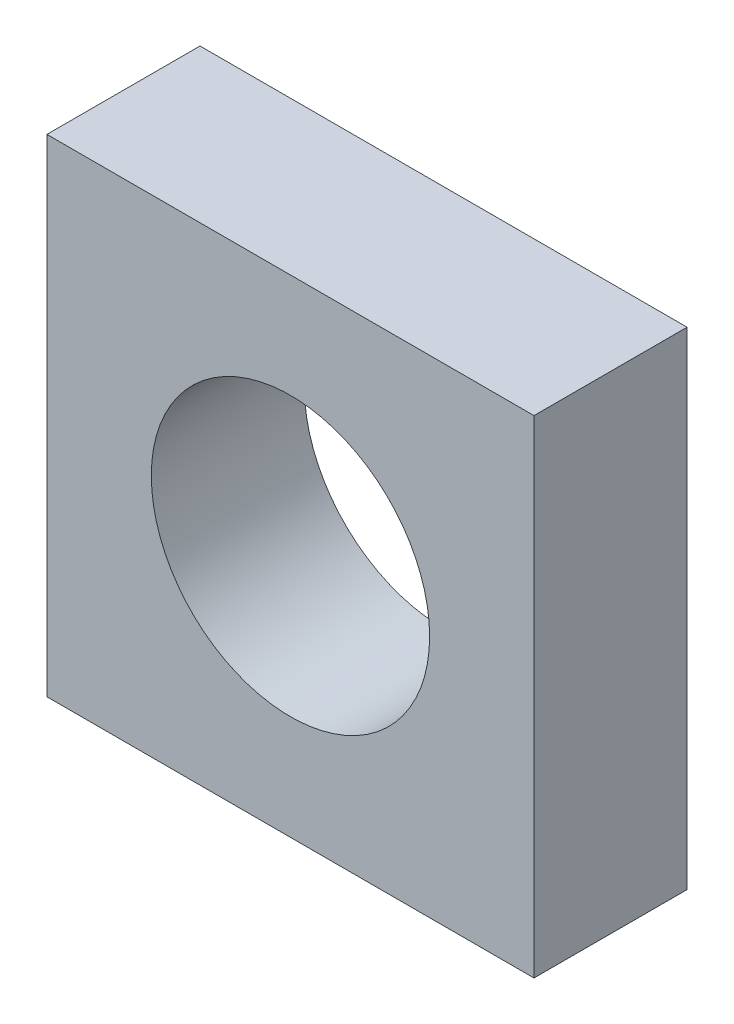
ISO-10303-21;
HEADER;
FILE_DESCRIPTION(('STEP AP214'),'2;1');
FILE_NAME('part.step','',(''),(''),'','','');
FILE_SCHEMA(('AUTOMOTIVE_DESIGN { 1 0 10303 214 1 1 1 1 }'));
ENDSEC;
DATA;
#1=APPLICATION_CONTEXT('core data for automotive mechanical design processes');
#2=APPLICATION_PROTOCOL_DEFINITION('international standard','automotive_design',2000,#1);
#3=PRODUCT_CONTEXT('',#1,'mechanical');
#4=PRODUCT('Part','Part','',(#3));
#5=PRODUCT_RELATED_PRODUCT_CATEGORY('part','',(#4));
#6=PRODUCT_DEFINITION_FORMATION('','',#4);
#7=PRODUCT_DEFINITION_CONTEXT('part definition',#1,'design');
#8=PRODUCT_DEFINITION('design','',#6,#7);
#9=PRODUCT_DEFINITION_SHAPE('','',#8);
#10=(LENGTH_UNIT() NAMED_UNIT(*) SI_UNIT(.MILLI.,.METRE.));
#11=(NAMED_UNIT(*) PLANE_ANGLE_UNIT() SI_UNIT($,.RADIAN.));
#12=(NAMED_UNIT(*) SI_UNIT($,.STERADIAN.) SOLID_ANGLE_UNIT());
#13=UNCERTAINTY_MEASURE_WITH_UNIT(LENGTH_MEASURE(1.E-05),#10,'distance_accuracy_value','');
#14=(GEOMETRIC_REPRESENTATION_CONTEXT(3) GLOBAL_UNCERTAINTY_ASSIGNED_CONTEXT((#13)) GLOBAL_UNIT_ASSIGNED_CONTEXT((#10,
#11,#12)) REPRESENTATION_CONTEXT('',''));
#15=CARTESIAN_POINT('',(0.,0.,0.));
#16=DIRECTION('',(0.,0.,1.));
#17=DIRECTION('',(1.,0.,0.));
#18=AXIS2_PLACEMENT_3D('',#15,#16,#17);
#19=CARTESIAN_POINT('',(3.5,-3.5,2.2));
#20=DIRECTION('',(-1.,0.,0.));
#21=DIRECTION('',(0.,0.,1.));
#22=AXIS2_PLACEMENT_3D('',#19,#20,#21);
#23=PLANE('',#22);
#24=DIRECTION('',(0.,1.,0.));
#25=VECTOR('',#24,1.);
#26=CARTESIAN_POINT('',(3.5,-3.5,0.));
#27=LINE('',#26,#25);
#28=CARTESIAN_POINT('',(3.5,-3.5,0.));
#29=VERTEX_POINT('',#28);
#30=CARTESIAN_POINT('',(3.5,3.5,0.));
#31=VERTEX_POINT('',#30);
#32=EDGE_CURVE('E110',#29,#31,#27,.T.);
#33=ORIENTED_EDGE('',*,*,#32,.T.);
#34=DIRECTION('',(0.,0.,-1.));
#35=VECTOR('',#34,1.);
#36=CARTESIAN_POINT('',(3.5,3.5,2.2));
#37=LINE('',#36,#35);
#38=CARTESIAN_POINT('',(3.5,3.5,2.2));
#39=VERTEX_POINT('',#38);
#40=EDGE_CURVE('E13',#39,#31,#37,.T.);
#41=ORIENTED_EDGE('',*,*,#40,.F.);
#42=DIRECTION('',(0.,1.,0.));
#43=VECTOR('',#42,1.);
#44=CARTESIAN_POINT('',(3.5,-3.5,2.2));
#45=LINE('',#44,#43);
#46=CARTESIAN_POINT('',(3.5,-3.5,2.2));
#47=VERTEX_POINT('',#46);
#48=EDGE_CURVE('E98',#47,#39,#45,.T.);
#49=ORIENTED_EDGE('',*,*,#48,.F.);
#50=DIRECTION('',(0.,0.,-1.));
#51=VECTOR('',#50,1.);
#52=CARTESIAN_POINT('',(3.5,-3.5,2.2));
#53=LINE('',#52,#51);
#54=EDGE_CURVE('E106',#47,#29,#53,.T.);
#55=ORIENTED_EDGE('',*,*,#54,.T.);
#56=EDGE_LOOP('',(#33,#41,#49,#55));
#57=FACE_BOUND('',#56,.T.);
#58=ADVANCED_FACE('F47',(#57),#23,.F.);
#59=CARTESIAN_POINT('',(-3.5,3.5,2.2));
#60=DIRECTION('',(0.,-1.,0.));
#61=DIRECTION('',(0.,0.,-1.));
#62=AXIS2_PLACEMENT_3D('',#59,#60,#61);
#63=PLANE('',#62);
#64=DIRECTION('',(-1.,0.,0.));
#65=VECTOR('',#64,1.);
#66=CARTESIAN_POINT('',(-3.5,3.5,0.));
#67=LINE('',#66,#65);
#68=CARTESIAN_POINT('',(-3.5,3.5,0.));
#69=VERTEX_POINT('',#68);
#70=EDGE_CURVE('E102',#31,#69,#67,.T.);
#71=ORIENTED_EDGE('',*,*,#70,.T.);
#72=DIRECTION('',(0.,0.,-1.));
#73=VECTOR('',#72,1.);
#74=CARTESIAN_POINT('',(-3.5,3.5,2.2));
#75=LINE('',#74,#73);
#76=CARTESIAN_POINT('',(-3.5,3.5,2.2));
#77=VERTEX_POINT('',#76);
#78=EDGE_CURVE('E55',#77,#69,#75,.T.);
#79=ORIENTED_EDGE('',*,*,#78,.F.);
#80=DIRECTION('',(-1.,0.,0.));
#81=VECTOR('',#80,1.);
#82=CARTESIAN_POINT('',(-3.5,3.5,2.2));
#83=LINE('',#82,#81);
#84=EDGE_CURVE('E93',#39,#77,#83,.T.);
#85=ORIENTED_EDGE('',*,*,#84,.F.);
#86=ORIENTED_EDGE('',*,*,#40,.T.);
#87=EDGE_LOOP('',(#71,#79,#85,#86));
#88=FACE_BOUND('',#87,.T.);
#89=ADVANCED_FACE('F101',(#88),#63,.F.);
#90=CARTESIAN_POINT('',(-3.5,-3.5,2.2));
#91=DIRECTION('',(1.,0.,0.));
#92=DIRECTION('',(0.,0.,-1.));
#93=AXIS2_PLACEMENT_3D('',#90,#91,#92);
#94=PLANE('',#93);
#95=DIRECTION('',(0.,-1.,0.));
#96=VECTOR('',#95,1.);
#97=CARTESIAN_POINT('',(-3.5,-3.5,0.));
#98=LINE('',#97,#96);
#99=CARTESIAN_POINT('',(-3.5,-3.5,0.));
#100=VERTEX_POINT('',#99);
#101=EDGE_CURVE('E80',#69,#100,#98,.T.);
#102=ORIENTED_EDGE('',*,*,#101,.T.);
#103=DIRECTION('',(0.,0.,-1.));
#104=VECTOR('',#103,1.);
#105=CARTESIAN_POINT('',(-3.5,-3.5,2.2));
#106=LINE('',#105,#104);
#107=CARTESIAN_POINT('',(-3.5,-3.5,2.2));
#108=VERTEX_POINT('',#107);
#109=EDGE_CURVE('E103',#108,#100,#106,.T.);
#110=ORIENTED_EDGE('',*,*,#109,.F.);
#111=DIRECTION('',(0.,-1.,0.));
#112=VECTOR('',#111,1.);
#113=CARTESIAN_POINT('',(-3.5,-3.5,2.2));
#114=LINE('',#113,#112);
#115=EDGE_CURVE('E96',#77,#108,#114,.T.);
#116=ORIENTED_EDGE('',*,*,#115,.F.);
#117=ORIENTED_EDGE('',*,*,#78,.T.);
#118=EDGE_LOOP('',(#102,#110,#116,#117));
#119=FACE_BOUND('',#118,.T.);
#120=ADVANCED_FACE('F104',(#119),#94,.F.);
#121=CARTESIAN_POINT('',(-3.5,-3.5,2.2));
#122=DIRECTION('',(0.,1.,0.));
#123=DIRECTION('',(0.,0.,1.));
#124=AXIS2_PLACEMENT_3D('',#121,#122,#123);
#125=PLANE('',#124);
#126=DIRECTION('',(1.,0.,0.));
#127=VECTOR('',#126,1.);
#128=CARTESIAN_POINT('',(-3.5,-3.5,0.));
#129=LINE('',#128,#127);
#130=EDGE_CURVE('E86',#100,#29,#129,.T.);
#131=ORIENTED_EDGE('',*,*,#130,.T.);
#132=ORIENTED_EDGE('',*,*,#54,.F.);
#133=DIRECTION('',(1.,0.,0.));
#134=VECTOR('',#133,1.);
#135=CARTESIAN_POINT('',(-3.5,-3.5,2.2));
#136=LINE('',#135,#134);
#137=EDGE_CURVE('E63',#108,#47,#136,.T.);
#138=ORIENTED_EDGE('',*,*,#137,.F.);
#139=ORIENTED_EDGE('',*,*,#109,.T.);
#140=EDGE_LOOP('',(#131,#132,#138,#139));
#141=FACE_BOUND('',#140,.T.);
#142=ADVANCED_FACE('F118',(#141),#125,.F.);
#143=CARTESIAN_POINT('',(0.,0.,2.2));
#144=DIRECTION('',(0.,0.,-1.));
#145=DIRECTION('',(-1.,0.,0.));
#146=AXIS2_PLACEMENT_3D('',#143,#144,#145);
#147=PLANE('',#146);
#148=CARTESIAN_POINT('',(0.000165227911594432,0.00184592230534254,2.2));
#149=DIRECTION('',(0.,0.,1.));
#150=DIRECTION('',(1.,0.,0.));
#151=AXIS2_PLACEMENT_3D('',#148,#149,#150);
#152=CIRCLE('',#151,2.);
#153=CARTESIAN_POINT('',(2.00016522791159,0.00184592230534254,2.2));
#154=VERTEX_POINT('',#153);
#155=EDGE_CURVE('E124',#154,#154,#152,.T.);
#156=ORIENTED_EDGE('',*,*,#155,.F.);
#157=EDGE_LOOP('',(#156));
#158=FACE_BOUND('',#157,.T.);
#159=ORIENTED_EDGE('',*,*,#48,.T.);
#160=ORIENTED_EDGE('',*,*,#84,.T.);
#161=ORIENTED_EDGE('',*,*,#115,.T.);
#162=ORIENTED_EDGE('',*,*,#137,.T.);
#163=EDGE_LOOP('',(#159,#160,#161,#162));
#164=FACE_BOUND('',#163,.T.);
#165=ADVANCED_FACE('F94',(#158,#164),#147,.F.);
#166=CARTESIAN_POINT('',(0.,0.,0.));
#167=DIRECTION('',(0.,0.,-1.));
#168=DIRECTION('',(-1.,0.,0.));
#169=AXIS2_PLACEMENT_3D('',#166,#167,#168);
#170=PLANE('',#169);
#171=CARTESIAN_POINT('',(0.000165227911594432,0.00184592230534254,0.));
#172=DIRECTION('',(0.,0.,1.));
#173=DIRECTION('',(1.,0.,0.));
#174=AXIS2_PLACEMENT_3D('',#171,#172,#173);
#175=CIRCLE('',#174,2.);
#176=CARTESIAN_POINT('',(2.00016522791159,0.00184592230534254,0.));
#177=VERTEX_POINT('',#176);
#178=EDGE_CURVE('E113',#177,#177,#175,.T.);
#179=ORIENTED_EDGE('',*,*,#178,.T.);
#180=EDGE_LOOP('',(#179));
#181=FACE_BOUND('',#180,.T.);
#182=ORIENTED_EDGE('',*,*,#32,.F.);
#183=ORIENTED_EDGE('',*,*,#130,.F.);
#184=ORIENTED_EDGE('',*,*,#101,.F.);
#185=ORIENTED_EDGE('',*,*,#70,.F.);
#186=EDGE_LOOP('',(#182,#183,#184,#185));
#187=FACE_BOUND('',#186,.T.);
#188=ADVANCED_FACE('F121',(#181,#187),#170,.T.);
#189=CARTESIAN_POINT('',(0.000165227911594432,0.00184592230534254,0.));
#190=DIRECTION('',(0.,0.,1.));
#191=DIRECTION('',(1.,0.,0.));
#192=AXIS2_PLACEMENT_3D('',#189,#190,#191);
#193=CYLINDRICAL_SURFACE('',#192,2.);
#194=ORIENTED_EDGE('',*,*,#178,.F.);
#195=EDGE_LOOP('',(#194));
#196=FACE_BOUND('',#195,.T.);
#197=ORIENTED_EDGE('',*,*,#155,.T.);
#198=EDGE_LOOP('',(#197));
#199=FACE_BOUND('',#198,.T.);
#200=ADVANCED_FACE('F131',(#196,#199),#193,.F.);
#201=CLOSED_SHELL('',(#58,#89,#120,#142,#165,#188,#200));
#202=MANIFOLD_SOLID_BREP('B2',#201);
#203=ADVANCED_BREP_SHAPE_REPRESENTATION('',(#18,#202),#14);
#204=SHAPE_DEFINITION_REPRESENTATION(#9,#203);
ENDSEC;
END-ISO-10303-21;
